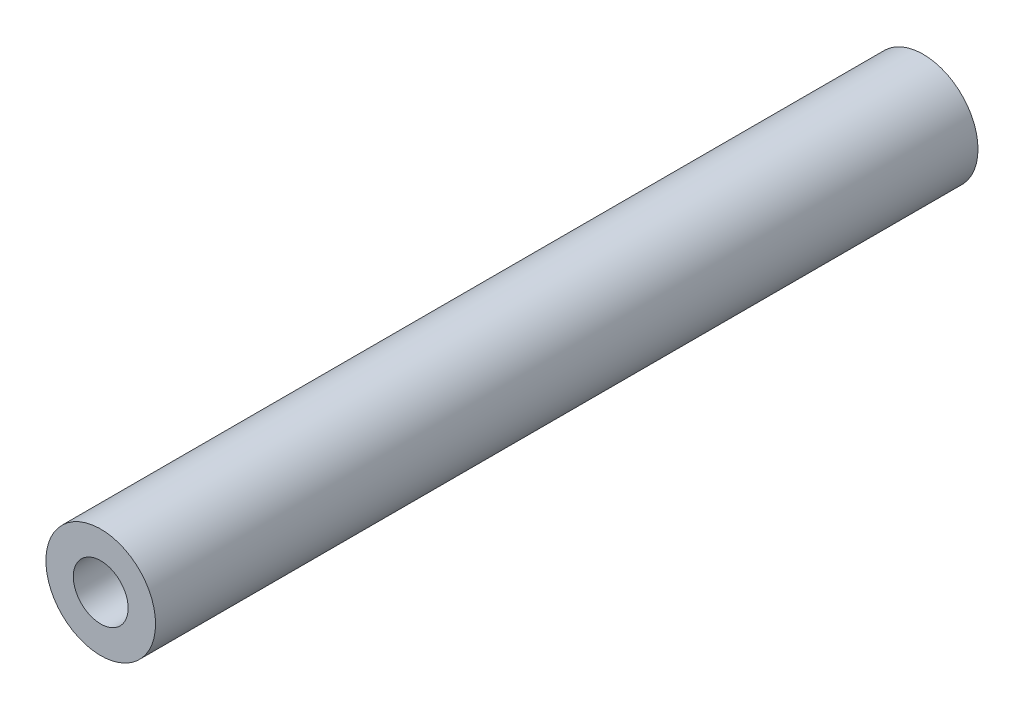
ISO-10303-21;
HEADER;
FILE_DESCRIPTION(('STEP AP214'),'2;1');
FILE_NAME('part.step','',(''),(''),'','','');
FILE_SCHEMA(('AUTOMOTIVE_DESIGN { 1 0 10303 214 1 1 1 1 }'));
ENDSEC;
DATA;
#1=APPLICATION_CONTEXT('core data for automotive mechanical design processes');
#2=APPLICATION_PROTOCOL_DEFINITION('international standard','automotive_design',2000,#1);
#3=PRODUCT_CONTEXT('',#1,'mechanical');
#4=PRODUCT('Part','Part','',(#3));
#5=PRODUCT_RELATED_PRODUCT_CATEGORY('part','',(#4));
#6=PRODUCT_DEFINITION_FORMATION('','',#4);
#7=PRODUCT_DEFINITION_CONTEXT('part definition',#1,'design');
#8=PRODUCT_DEFINITION('design','',#6,#7);
#9=PRODUCT_DEFINITION_SHAPE('','',#8);
#10=(LENGTH_UNIT() NAMED_UNIT(*) SI_UNIT(.MILLI.,.METRE.));
#11=(NAMED_UNIT(*) PLANE_ANGLE_UNIT() SI_UNIT($,.RADIAN.));
#12=(NAMED_UNIT(*) SI_UNIT($,.STERADIAN.) SOLID_ANGLE_UNIT());
#13=UNCERTAINTY_MEASURE_WITH_UNIT(LENGTH_MEASURE(1.E-05),#10,'distance_accuracy_value','');
#14=(GEOMETRIC_REPRESENTATION_CONTEXT(3) GLOBAL_UNCERTAINTY_ASSIGNED_CONTEXT((#13)) GLOBAL_UNIT_ASSIGNED_CONTEXT((#10,
#11,#12)) REPRESENTATION_CONTEXT('',''));
#15=CARTESIAN_POINT('',(0.,0.,0.));
#16=DIRECTION('',(0.,0.,1.));
#17=DIRECTION('',(1.,0.,0.));
#18=AXIS2_PLACEMENT_3D('',#15,#16,#17);
#19=CARTESIAN_POINT('',(0.,0.,30.));
#20=DIRECTION('',(0.,0.,1.));
#21=DIRECTION('',(1.,0.,0.));
#22=AXIS2_PLACEMENT_3D('',#19,#20,#21);
#23=PLANE('',#22);
#24=CARTESIAN_POINT('',(0.,0.,30.));
#25=DIRECTION('',(0.,0.,1.));
#26=DIRECTION('',(1.,0.,0.));
#27=AXIS2_PLACEMENT_3D('',#24,#25,#26);
#28=CIRCLE('',#27,2.);
#29=CARTESIAN_POINT('',(2.,0.,30.));
#30=VERTEX_POINT('',#29);
#31=EDGE_CURVE('E10',#30,#30,#28,.T.);
#32=ORIENTED_EDGE('',*,*,#31,.T.);
#33=EDGE_LOOP('',(#32));
#34=FACE_BOUND('',#33,.T.);
#35=CARTESIAN_POINT('',(0.,0.,30.));
#36=DIRECTION('',(0.,0.,1.));
#37=DIRECTION('',(1.,0.,0.));
#38=AXIS2_PLACEMENT_3D('',#35,#36,#37);
#39=CIRCLE('',#38,1.);
#40=CARTESIAN_POINT('',(1.,0.,30.));
#41=VERTEX_POINT('',#40);
#42=EDGE_CURVE('E41',#41,#41,#39,.T.);
#43=ORIENTED_EDGE('',*,*,#42,.F.);
#44=EDGE_LOOP('',(#43));
#45=FACE_BOUND('',#44,.T.);
#46=ADVANCED_FACE('F30',(#34,#45),#23,.T.);
#47=CARTESIAN_POINT('',(0.,0.,0.));
#48=DIRECTION('',(0.,0.,1.));
#49=DIRECTION('',(1.,0.,0.));
#50=AXIS2_PLACEMENT_3D('',#47,#48,#49);
#51=PLANE('',#50);
#52=CARTESIAN_POINT('',(0.,0.,0.));
#53=DIRECTION('',(0.,0.,1.));
#54=DIRECTION('',(1.,0.,0.));
#55=AXIS2_PLACEMENT_3D('',#52,#53,#54);
#56=CIRCLE('',#55,2.);
#57=CARTESIAN_POINT('',(2.,0.,0.));
#58=VERTEX_POINT('',#57);
#59=EDGE_CURVE('E34',#58,#58,#56,.T.);
#60=ORIENTED_EDGE('',*,*,#59,.F.);
#61=EDGE_LOOP('',(#60));
#62=FACE_BOUND('',#61,.T.);
#63=CARTESIAN_POINT('',(0.,0.,0.));
#64=DIRECTION('',(0.,0.,1.));
#65=DIRECTION('',(1.,0.,0.));
#66=AXIS2_PLACEMENT_3D('',#63,#64,#65);
#67=CIRCLE('',#66,1.);
#68=CARTESIAN_POINT('',(1.,0.,0.));
#69=VERTEX_POINT('',#68);
#70=EDGE_CURVE('E43',#69,#69,#67,.T.);
#71=ORIENTED_EDGE('',*,*,#70,.T.);
#72=EDGE_LOOP('',(#71));
#73=FACE_BOUND('',#72,.T.);
#74=ADVANCED_FACE('F53',(#62,#73),#51,.F.);
#75=CARTESIAN_POINT('',(0.,0.,30.));
#76=DIRECTION('',(0.,0.,-1.));
#77=DIRECTION('',(-1.,0.,0.));
#78=AXIS2_PLACEMENT_3D('',#75,#76,#77);
#79=CYLINDRICAL_SURFACE('',#78,2.);
#80=ORIENTED_EDGE('',*,*,#31,.F.);
#81=EDGE_LOOP('',(#80));
#82=FACE_BOUND('',#81,.T.);
#83=ORIENTED_EDGE('',*,*,#59,.T.);
#84=EDGE_LOOP('',(#83));
#85=FACE_BOUND('',#84,.T.);
#86=ADVANCED_FACE('F32',(#82,#85),#79,.T.);
#87=CARTESIAN_POINT('',(0.,0.,30.));
#88=DIRECTION('',(0.,0.,-1.));
#89=DIRECTION('',(-1.,0.,0.));
#90=AXIS2_PLACEMENT_3D('',#87,#88,#89);
#91=CYLINDRICAL_SURFACE('',#90,1.);
#92=ORIENTED_EDGE('',*,*,#42,.T.);
#93=EDGE_LOOP('',(#92));
#94=FACE_BOUND('',#93,.T.);
#95=ORIENTED_EDGE('',*,*,#70,.F.);
#96=EDGE_LOOP('',(#95));
#97=FACE_BOUND('',#96,.T.);
#98=ADVANCED_FACE('F49',(#94,#97),#91,.F.);
#99=CLOSED_SHELL('',(#46,#74,#86,#98));
#100=MANIFOLD_SOLID_BREP('B2',#99);
#101=ADVANCED_BREP_SHAPE_REPRESENTATION('',(#18,#100),#14);
#102=SHAPE_DEFINITION_REPRESENTATION(#9,#101);
ENDSEC;
END-ISO-10303-21;
